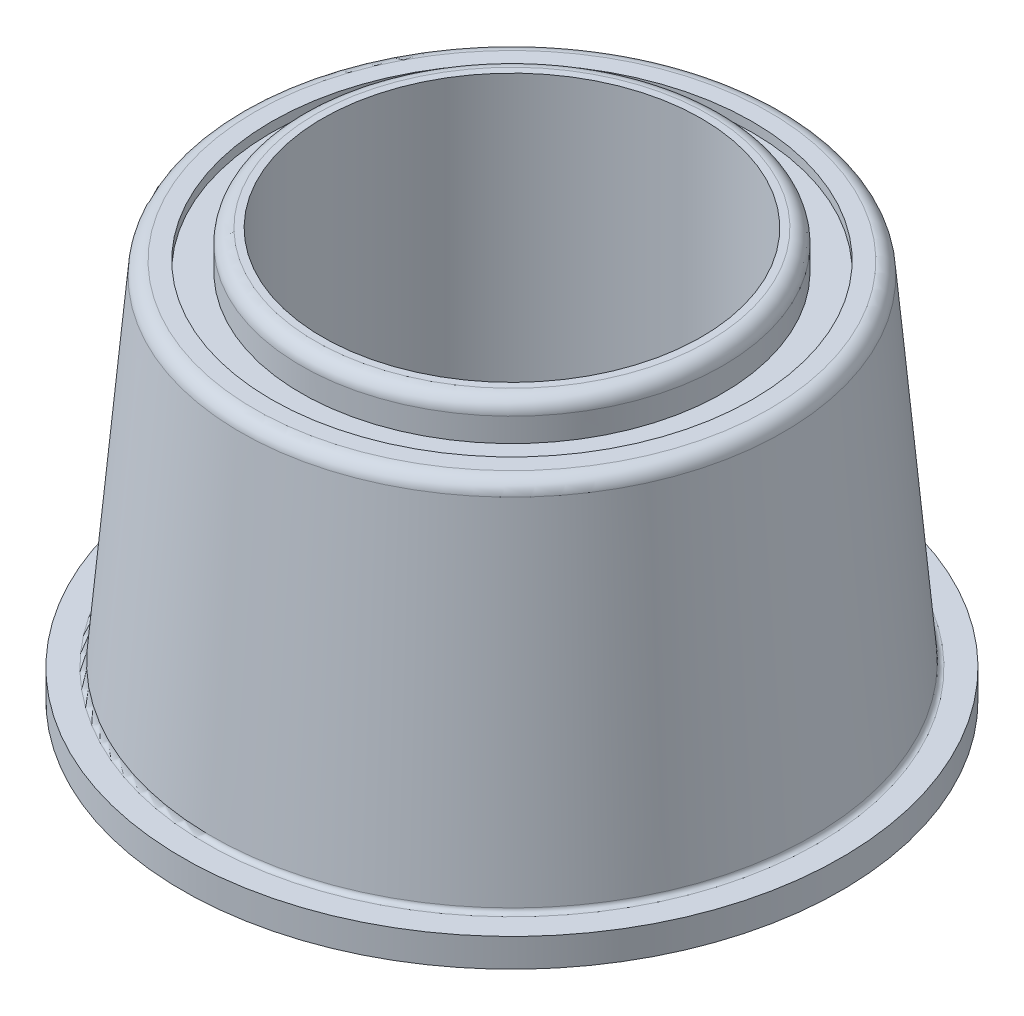
ISO-10303-21;
HEADER;
FILE_DESCRIPTION(('STEP AP214'),'2;1');
FILE_NAME('part.step','',(''),(''),'','','');
FILE_SCHEMA(('AUTOMOTIVE_DESIGN { 1 0 10303 214 1 1 1 1 }'));
ENDSEC;
DATA;
#1=APPLICATION_CONTEXT('core data for automotive mechanical design processes');
#2=APPLICATION_PROTOCOL_DEFINITION('international standard','automotive_design',2000,#1);
#3=PRODUCT_CONTEXT('',#1,'mechanical');
#4=PRODUCT('Part','Part','',(#3));
#5=PRODUCT_RELATED_PRODUCT_CATEGORY('part','',(#4));
#6=PRODUCT_DEFINITION_FORMATION('','',#4);
#7=PRODUCT_DEFINITION_CONTEXT('part definition',#1,'design');
#8=PRODUCT_DEFINITION('design','',#6,#7);
#9=PRODUCT_DEFINITION_SHAPE('','',#8);
#10=(LENGTH_UNIT() NAMED_UNIT(*) SI_UNIT(.MILLI.,.METRE.));
#11=(NAMED_UNIT(*) PLANE_ANGLE_UNIT() SI_UNIT($,.RADIAN.));
#12=(NAMED_UNIT(*) SI_UNIT($,.STERADIAN.) SOLID_ANGLE_UNIT());
#13=UNCERTAINTY_MEASURE_WITH_UNIT(LENGTH_MEASURE(1.E-05),#10,'distance_accuracy_value','');
#14=(GEOMETRIC_REPRESENTATION_CONTEXT(3) GLOBAL_UNCERTAINTY_ASSIGNED_CONTEXT((#13)) GLOBAL_UNIT_ASSIGNED_CONTEXT((#10,
#11,#12)) REPRESENTATION_CONTEXT('',''));
#15=CARTESIAN_POINT('',(0.,0.,0.));
#16=DIRECTION('',(0.,0.,1.));
#17=DIRECTION('',(1.,0.,0.));
#18=AXIS2_PLACEMENT_3D('',#15,#16,#17);
#19=CARTESIAN_POINT('',(0.,11.34,0.));
#20=DIRECTION('',(0.,-1.,0.));
#21=DIRECTION('',(0.,0.,-1.));
#22=AXIS2_PLACEMENT_3D('',#19,#20,#21);
#23=CYLINDRICAL_SURFACE('',#22,5.);
#24=CARTESIAN_POINT('',(0.,-0.750000000000001,0.));
#25=DIRECTION('',(0.,-1.,0.));
#26=DIRECTION('',(0.,0.,-1.));
#27=AXIS2_PLACEMENT_3D('',#24,#25,#26);
#28=CIRCLE('',#27,5.);
#29=CARTESIAN_POINT('',(0.,-0.750000000000001,-5.));
#30=VERTEX_POINT('',#29);
#31=EDGE_CURVE('E63',#30,#30,#28,.T.);
#32=ORIENTED_EDGE('',*,*,#31,.T.);
#33=EDGE_LOOP('',(#32));
#34=FACE_BOUND('',#33,.T.);
#35=CARTESIAN_POINT('',(0.,10.8,0.));
#36=DIRECTION('',(0.,-1.,0.));
#37=DIRECTION('',(0.,0.,-1.));
#38=AXIS2_PLACEMENT_3D('',#35,#36,#37);
#39=CIRCLE('',#38,5.);
#40=CARTESIAN_POINT('',(0.,10.8,-5.));
#41=VERTEX_POINT('',#40);
#42=EDGE_CURVE('E281',#41,#41,#39,.F.);
#43=ORIENTED_EDGE('',*,*,#42,.T.);
#44=EDGE_LOOP('',(#43));
#45=FACE_BOUND('',#44,.T.);
#46=ADVANCED_FACE('F16',(#34,#45),#23,.F.);
#47=CARTESIAN_POINT('',(0.,10.8,0.));
#48=DIRECTION('',(0.,-1.,0.));
#49=DIRECTION('',(0.,0.,-1.));
#50=AXIS2_PLACEMENT_3D('',#47,#48,#49);
#51=PLANE('',#50);
#52=ORIENTED_EDGE('',*,*,#42,.F.);
#53=EDGE_LOOP('',(#52));
#54=FACE_BOUND('',#53,.T.);
#55=CARTESIAN_POINT('',(0.,10.8,0.));
#56=DIRECTION('',(0.,-1.,0.));
#57=DIRECTION('',(-1.,0.,0.));
#58=AXIS2_PLACEMENT_3D('',#55,#56,#57);
#59=CIRCLE('',#58,5.189999901015);
#60=CARTESIAN_POINT('',(-5.189999841624,10.8,0.));
#61=VERTEX_POINT('',#60);
#62=CARTESIAN_POINT('',(5.189999841624,10.8,0.));
#63=VERTEX_POINT('',#62);
#64=EDGE_CURVE('E61',#61,#63,#59,.T.);
#65=ORIENTED_EDGE('',*,*,#64,.F.);
#66=CARTESIAN_POINT('',(0.,10.7999999999999,0.));
#67=DIRECTION('',(0.,-1.,0.));
#68=DIRECTION('',(1.,0.,0.));
#69=AXIS2_PLACEMENT_3D('',#66,#67,#68);
#70=CIRCLE('',#69,5.18999980203);
#71=EDGE_CURVE('E56',#63,#61,#70,.T.);
#72=ORIENTED_EDGE('',*,*,#71,.F.);
#73=EDGE_LOOP('',(#65,#72));
#74=FACE_BOUND('',#73,.T.);
#75=ADVANCED_FACE('F60',(#54,#74),#51,.F.);
#76=CARTESIAN_POINT('',(0.,-0.75,0.));
#77=DIRECTION('',(0.,1.,0.));
#78=DIRECTION('',(0.,0.,1.));
#79=AXIS2_PLACEMENT_3D('',#76,#77,#78);
#80=PLANE('',#79);
#81=ORIENTED_EDGE('',*,*,#31,.F.);
#82=EDGE_LOOP('',(#81));
#83=FACE_BOUND('',#82,.T.);
#84=CARTESIAN_POINT('',(0.,-0.75,0.));
#85=DIRECTION('',(0.,1.,0.));
#86=DIRECTION('',(0.,0.,1.));
#87=AXIS2_PLACEMENT_3D('',#84,#85,#86);
#88=CIRCLE('',#87,5.565);
#89=CARTESIAN_POINT('',(0.,-0.75,5.565));
#90=VERTEX_POINT('',#89);
#91=EDGE_CURVE('E68',#90,#90,#88,.T.);
#92=ORIENTED_EDGE('',*,*,#91,.F.);
#93=EDGE_LOOP('',(#92));
#94=FACE_BOUND('',#93,.T.);
#95=ADVANCED_FACE('F88',(#83,#94),#80,.F.);
#96=CARTESIAN_POINT('',(0.,10.425,0.));
#97=DIRECTION('',(0.,-1.,0.));
#98=DIRECTION('',(0.999943058778781,0.,0.0106714197806798));
#99=AXIS2_PLACEMENT_3D('',#96,#97,#98);
#100=TOROIDAL_SURFACE('',#99,5.19,0.375);
#101=CARTESIAN_POINT('',(0.,10.425,0.));
#102=DIRECTION('',(0.,-1.,0.));
#103=DIRECTION('',(0.,0.,-1.));
#104=AXIS2_PLACEMENT_3D('',#101,#102,#103);
#105=CIRCLE('',#104,5.565);
#106=CARTESIAN_POINT('',(0.,10.425,-5.565));
#107=VERTEX_POINT('',#106);
#108=EDGE_CURVE('E97',#107,#107,#105,.T.);
#109=ORIENTED_EDGE('',*,*,#108,.F.);
#110=EDGE_LOOP('',(#109));
#111=FACE_BOUND('',#110,.T.);
#112=ORIENTED_EDGE('',*,*,#64,.T.);
#113=ORIENTED_EDGE('',*,*,#71,.T.);
#114=EDGE_LOOP('',(#112,#113));
#115=FACE_BOUND('',#114,.T.);
#116=ADVANCED_FACE('F67',(#111,#115),#100,.T.);
#117=CARTESIAN_POINT('',(0.,-0.7875,0.));
#118=DIRECTION('',(0.,1.,0.));
#119=DIRECTION('',(0.,0.,1.));
#120=AXIS2_PLACEMENT_3D('',#117,#118,#119);
#121=CYLINDRICAL_SURFACE('',#120,5.565);
#122=ORIENTED_EDGE('',*,*,#91,.T.);
#123=EDGE_LOOP('',(#122));
#124=FACE_BOUND('',#123,.T.);
#125=CARTESIAN_POINT('',(0.,-0.125,0.));
#126=DIRECTION('',(0.,1.,0.));
#127=DIRECTION('',(-0.999943058778781,0.,0.0106714197806798));
#128=AXIS2_PLACEMENT_3D('',#125,#126,#127);
#129=CIRCLE('',#128,5.565);
#130=CARTESIAN_POINT('',(-5.56468312210392,-0.125,0.0593864510794831));
#131=VERTEX_POINT('',#130);
#132=EDGE_CURVE('E95',#131,#131,#129,.F.);
#133=ORIENTED_EDGE('',*,*,#132,.T.);
#134=EDGE_LOOP('',(#133));
#135=FACE_BOUND('',#134,.T.);
#136=ADVANCED_FACE('F87',(#124,#135),#121,.T.);
#137=CARTESIAN_POINT('',(0.,11.34,0.));
#138=DIRECTION('',(0.,-1.,0.));
#139=DIRECTION('',(0.,0.,-1.));
#140=AXIS2_PLACEMENT_3D('',#137,#138,#139);
#141=CYLINDRICAL_SURFACE('',#140,5.565);
#142=CARTESIAN_POINT('',(0.,9.8,0.));
#143=DIRECTION('',(0.,-1.,0.));
#144=DIRECTION('',(0.,0.,-1.));
#145=AXIS2_PLACEMENT_3D('',#142,#143,#144);
#146=CIRCLE('',#145,5.565);
#147=CARTESIAN_POINT('',(0.,9.8,-5.565));
#148=VERTEX_POINT('',#147);
#149=EDGE_CURVE('E288',#148,#148,#146,.F.);
#150=ORIENTED_EDGE('',*,*,#149,.T.);
#151=EDGE_LOOP('',(#150));
#152=FACE_BOUND('',#151,.T.);
#153=ORIENTED_EDGE('',*,*,#108,.T.);
#154=EDGE_LOOP('',(#153));
#155=FACE_BOUND('',#154,.T.);
#156=ADVANCED_FACE('F248',(#152,#155),#141,.T.);
#157=CARTESIAN_POINT('',(0.,-0.125,0.));
#158=DIRECTION('',(0.,1.,0.));
#159=DIRECTION('',(-0.999943058778781,0.,0.0106714197806798));
#160=AXIS2_PLACEMENT_3D('',#157,#158,#159);
#161=TOROIDAL_SURFACE('',#160,5.69,0.125);
#162=ORIENTED_EDGE('',*,*,#132,.F.);
#163=EDGE_LOOP('',(#162));
#164=FACE_BOUND('',#163,.T.);
#165=CARTESIAN_POINT('',(0.,0.,0.));
#166=DIRECTION('',(0.,-1.,0.));
#167=DIRECTION('',(1.,0.,0.));
#168=AXIS2_PLACEMENT_3D('',#165,#166,#167);
#169=CIRCLE('',#168,5.689999972943);
#170=CARTESIAN_POINT('',(-5.6899999810601,0.,0.));
#171=VERTEX_POINT('',#170);
#172=CARTESIAN_POINT('',(5.6899999810601,0.,0.));
#173=VERTEX_POINT('',#172);
#174=EDGE_CURVE('E215',#171,#173,#169,.F.);
#175=ORIENTED_EDGE('',*,*,#174,.F.);
#176=CARTESIAN_POINT('',(0.,0.,0.));
#177=DIRECTION('',(0.,-1.,0.));
#178=DIRECTION('',(-1.,0.,0.));
#179=AXIS2_PLACEMENT_3D('',#176,#177,#178);
#180=CIRCLE('',#179,5.6899999864715);
#181=EDGE_CURVE('E295',#173,#171,#180,.F.);
#182=ORIENTED_EDGE('',*,*,#181,.F.);
#183=EDGE_LOOP('',(#175,#182));
#184=FACE_BOUND('',#183,.T.);
#185=ADVANCED_FACE('F245',(#164,#184),#161,.F.);
#186=CARTESIAN_POINT('',(0.,9.8,0.));
#187=DIRECTION('',(0.,-1.,0.));
#188=DIRECTION('',(0.,0.,-1.));
#189=AXIS2_PLACEMENT_3D('',#186,#187,#188);
#190=PLANE('',#189);
#191=ORIENTED_EDGE('',*,*,#149,.F.);
#192=EDGE_LOOP('',(#191));
#193=FACE_BOUND('',#192,.T.);
#194=CARTESIAN_POINT('',(0.,9.8,0.));
#195=DIRECTION('',(0.,-1.,0.));
#196=DIRECTION('',(0.,0.,-1.));
#197=AXIS2_PLACEMENT_3D('',#194,#195,#196);
#198=CIRCLE('',#197,6.350677714604);
#199=CARTESIAN_POINT('',(0.,9.8,-6.350677714604));
#200=VERTEX_POINT('',#199);
#201=EDGE_CURVE('E291',#200,#200,#198,.F.);
#202=ORIENTED_EDGE('',*,*,#201,.T.);
#203=EDGE_LOOP('',(#202));
#204=FACE_BOUND('',#203,.T.);
#205=ADVANCED_FACE('F232',(#193,#204),#190,.F.);
#206=CARTESIAN_POINT('',(0.,0.,0.));
#207=DIRECTION('',(0.,-1.,0.));
#208=DIRECTION('',(0.,0.,-1.));
#209=AXIS2_PLACEMENT_3D('',#206,#207,#208);
#210=PLANE('',#209);
#211=ORIENTED_EDGE('',*,*,#174,.T.);
#212=ORIENTED_EDGE('',*,*,#181,.T.);
#213=EDGE_LOOP('',(#211,#212));
#214=FACE_BOUND('',#213,.T.);
#215=CARTESIAN_POINT('',(0.,0.,0.));
#216=DIRECTION('',(0.,-1.,0.));
#217=DIRECTION('',(0.,0.,-1.));
#218=AXIS2_PLACEMENT_3D('',#215,#216,#217);
#219=CIRCLE('',#218,8.7);
#220=CARTESIAN_POINT('',(0.,0.,-8.7));
#221=VERTEX_POINT('',#220);
#222=EDGE_CURVE('E294',#221,#221,#219,.F.);
#223=ORIENTED_EDGE('',*,*,#222,.F.);
#224=EDGE_LOOP('',(#223));
#225=FACE_BOUND('',#224,.T.);
#226=ADVANCED_FACE('F221',(#214,#225),#210,.T.);
#227=CARTESIAN_POINT('',(0.,10.0625,0.));
#228=DIRECTION('',(0.,-1.,0.));
#229=DIRECTION('',(0.,0.,-1.));
#230=AXIS2_PLACEMENT_3D('',#227,#228,#229);
#231=CYLINDRICAL_SURFACE('',#230,6.350677714604);
#232=ORIENTED_EDGE('',*,*,#201,.F.);
#233=EDGE_LOOP('',(#232));
#234=FACE_BOUND('',#233,.T.);
#235=CARTESIAN_POINT('',(0.,10.05,0.));
#236=DIRECTION('',(0.,-1.,0.));
#237=DIRECTION('',(0.,0.,-1.));
#238=AXIS2_PLACEMENT_3D('',#235,#236,#237);
#239=CIRCLE('',#238,6.350677714604);
#240=CARTESIAN_POINT('',(0.,10.05,-6.350677714604));
#241=VERTEX_POINT('',#240);
#242=EDGE_CURVE('E297',#241,#241,#239,.F.);
#243=ORIENTED_EDGE('',*,*,#242,.T.);
#244=EDGE_LOOP('',(#243));
#245=FACE_BOUND('',#244,.T.);
#246=ADVANCED_FACE('F231',(#234,#245),#231,.F.);
#247=CARTESIAN_POINT('',(0.,11.34,0.));
#248=DIRECTION('',(0.,-1.,0.));
#249=DIRECTION('',(0.,0.,-1.));
#250=AXIS2_PLACEMENT_3D('',#247,#248,#249);
#251=CYLINDRICAL_SURFACE('',#250,8.7);
#252=ORIENTED_EDGE('',*,*,#222,.T.);
#253=EDGE_LOOP('',(#252));
#254=FACE_BOUND('',#253,.T.);
#255=CARTESIAN_POINT('',(0.,0.750000000000001,0.));
#256=DIRECTION('',(0.,-1.,0.));
#257=DIRECTION('',(0.,0.,-1.));
#258=AXIS2_PLACEMENT_3D('',#255,#256,#257);
#259=CIRCLE('',#258,8.7);
#260=CARTESIAN_POINT('',(0.,0.750000000000001,-8.7));
#261=VERTEX_POINT('',#260);
#262=EDGE_CURVE('E75',#261,#261,#259,.T.);
#263=ORIENTED_EDGE('',*,*,#262,.T.);
#264=EDGE_LOOP('',(#263));
#265=FACE_BOUND('',#264,.T.);
#266=ADVANCED_FACE('F304',(#254,#265),#251,.T.);
#267=CARTESIAN_POINT('',(0.,10.05,0.));
#268=DIRECTION('',(0.,-1.,0.));
#269=DIRECTION('',(0.,0.,-1.));
#270=AXIS2_PLACEMENT_3D('',#267,#268,#269);
#271=PLANE('',#270);
#272=ORIENTED_EDGE('',*,*,#242,.F.);
#273=EDGE_LOOP('',(#272));
#274=FACE_BOUND('',#273,.T.);
#275=CARTESIAN_POINT('',(0.,10.05,0.));
#276=DIRECTION('',(0.,-1.,0.));
#277=DIRECTION('',(-1.,0.,0.));
#278=AXIS2_PLACEMENT_3D('',#275,#276,#277);
#279=CIRCLE('',#278,6.7927312047305);
#280=CARTESIAN_POINT('',(-6.7927311841976,10.05,0.));
#281=VERTEX_POINT('',#280);
#282=CARTESIAN_POINT('',(6.7927311841976,10.05,0.));
#283=VERTEX_POINT('',#282);
#284=EDGE_CURVE('E181',#281,#283,#279,.T.);
#285=ORIENTED_EDGE('',*,*,#284,.F.);
#286=CARTESIAN_POINT('',(0.,10.05,0.));
#287=DIRECTION('',(0.,-1.,0.));
#288=DIRECTION('',(1.,0.,0.));
#289=AXIS2_PLACEMENT_3D('',#286,#287,#288);
#290=CIRCLE('',#289,6.792731170509);
#291=EDGE_CURVE('E191',#283,#281,#290,.T.);
#292=ORIENTED_EDGE('',*,*,#291,.F.);
#293=EDGE_LOOP('',(#285,#292));
#294=FACE_BOUND('',#293,.T.);
#295=ADVANCED_FACE('F157',(#274,#294),#271,.F.);
#296=CARTESIAN_POINT('',(0.,0.75,0.));
#297=DIRECTION('',(0.,-1.,0.));
#298=DIRECTION('',(0.,0.,-1.));
#299=AXIS2_PLACEMENT_3D('',#296,#297,#298);
#300=PLANE('',#299);
#301=CARTESIAN_POINT('',(0.,0.75,0.));
#302=DIRECTION('',(0.,1.,0.));
#303=DIRECTION('',(1.,0.,0.));
#304=AXIS2_PLACEMENT_3D('',#301,#302,#303);
#305=CIRCLE('',#304,8.064541404264);
#306=CARTESIAN_POINT('',(-8.0645414072688,0.75,0.));
#307=VERTEX_POINT('',#306);
#308=CARTESIAN_POINT('',(8.0645414072688,0.75,0.));
#309=VERTEX_POINT('',#308);
#310=EDGE_CURVE('E143',#307,#309,#305,.F.);
#311=ORIENTED_EDGE('',*,*,#310,.T.);
#312=CARTESIAN_POINT('',(0.,0.750000000000001,0.));
#313=DIRECTION('',(0.,1.,0.));
#314=DIRECTION('',(-1.,0.,0.));
#315=AXIS2_PLACEMENT_3D('',#312,#313,#314);
#316=CIRCLE('',#315,8.064541411776);
#317=EDGE_CURVE('E35',#307,#309,#316,.T.);
#318=ORIENTED_EDGE('',*,*,#317,.F.);
#319=EDGE_LOOP('',(#311,#318));
#320=FACE_BOUND('',#319,.T.);
#321=ORIENTED_EDGE('',*,*,#262,.F.);
#322=EDGE_LOOP('',(#321));
#323=FACE_BOUND('',#322,.T.);
#324=ADVANCED_FACE('F148',(#320,#323),#300,.F.);
#325=CARTESIAN_POINT('',(0.,9.675,0.));
#326=DIRECTION('',(0.,-1.,0.));
#327=DIRECTION('',(0.999969007949321,0.,0.00787293724416117));
#328=AXIS2_PLACEMENT_3D('',#325,#326,#327);
#329=TOROIDAL_SURFACE('',#328,6.792731238952,0.375);
#330=CARTESIAN_POINT('',(0.,9.70768341043103,0.));
#331=DIRECTION('',(0.,-1.,0.));
#332=DIRECTION('',(-1.,0.,0.));
#333=AXIS2_PLACEMENT_3D('',#330,#331,#332);
#334=CIRCLE('',#333,7.16630425013327);
#335=CARTESIAN_POINT('',(-7.16630425013327,9.70768341043103,0.));
#336=VERTEX_POINT('',#335);
#337=EDGE_CURVE('E27',#336,#336,#334,.T.);
#338=ORIENTED_EDGE('',*,*,#337,.F.);
#339=EDGE_LOOP('',(#338));
#340=FACE_BOUND('',#339,.T.);
#341=ORIENTED_EDGE('',*,*,#284,.T.);
#342=ORIENTED_EDGE('',*,*,#291,.T.);
#343=EDGE_LOOP('',(#341,#342));
#344=FACE_BOUND('',#343,.T.);
#345=ADVANCED_FACE('F126',(#340,#344),#329,.T.);
#346=CARTESIAN_POINT('',(0.,0.875,0.));
#347=DIRECTION('',(0.,-1.,0.));
#348=DIRECTION('',(-0.999983191684538,0.,0.00579796071090922));
#349=AXIS2_PLACEMENT_3D('',#346,#347,#348);
#350=TOROIDAL_SURFACE('',#349,8.064541396752,0.125);
#351=ORIENTED_EDGE('',*,*,#317,.T.);
#352=ORIENTED_EDGE('',*,*,#310,.F.);
#353=EDGE_LOOP('',(#351,#352));
#354=FACE_BOUND('',#353,.T.);
#355=CARTESIAN_POINT('',(0.,0.864105530887782,0.));
#356=DIRECTION('',(0.,-1.,0.));
#357=DIRECTION('',(-1.,0.,0.));
#358=AXIS2_PLACEMENT_3D('',#355,#356,#357);
#359=CIRCLE('',#358,7.94001705960179);
#360=CARTESIAN_POINT('',(-7.94001705960179,0.864105530887781,0.));
#361=VERTEX_POINT('',#360);
#362=EDGE_CURVE('E10',#361,#361,#359,.F.);
#363=ORIENTED_EDGE('',*,*,#362,.F.);
#364=EDGE_LOOP('',(#363));
#365=FACE_BOUND('',#364,.T.);
#366=ADVANCED_FACE('F120',(#354,#365),#350,.F.);
#367=CARTESIAN_POINT('',(0.,0.864105530887782,0.));
#368=DIRECTION('',(0.,-1.,0.));
#369=DIRECTION('',(0.,0.,-1.));
#370=AXIS2_PLACEMENT_3D('',#367,#368,#369);
#371=CONICAL_SURFACE('',#370,7.94001705960179,0.0872664625996999);
#372=ORIENTED_EDGE('',*,*,#337,.T.);
#373=EDGE_LOOP('',(#372));
#374=FACE_BOUND('',#373,.T.);
#375=ORIENTED_EDGE('',*,*,#362,.T.);
#376=EDGE_LOOP('',(#375));
#377=FACE_BOUND('',#376,.T.);
#378=ADVANCED_FACE('F118',(#374,#377),#371,.T.);
#379=CLOSED_SHELL('',(#46,#75,#95,#116,#136,#156,#185,#205,#226,#246,#266,#295,#324,#345,#366,#378));
#380=MANIFOLD_SOLID_BREP('B1',#379);
#381=ADVANCED_BREP_SHAPE_REPRESENTATION('',(#18,#380),#14);
#382=SHAPE_DEFINITION_REPRESENTATION(#9,#381);
ENDSEC;
END-ISO-10303-21;
